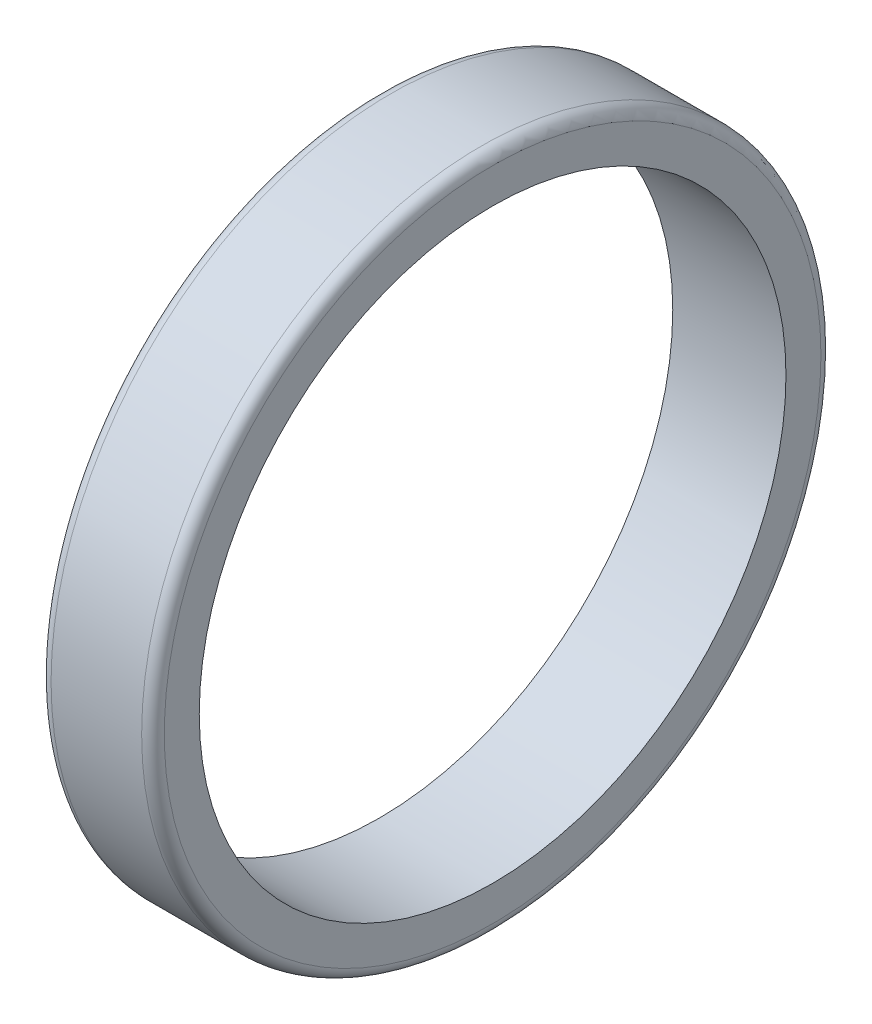
ISO-10303-21;
HEADER;
FILE_DESCRIPTION(('STEP AP214'),'2;1');
FILE_NAME('part.step','',(''),(''),'','','');
FILE_SCHEMA(('AUTOMOTIVE_DESIGN { 1 0 10303 214 1 1 1 1 }'));
ENDSEC;
DATA;
#1=APPLICATION_CONTEXT('core data for automotive mechanical design processes');
#2=APPLICATION_PROTOCOL_DEFINITION('international standard','automotive_design',2000,#1);
#3=PRODUCT_CONTEXT('',#1,'mechanical');
#4=PRODUCT('Part','Part','',(#3));
#5=PRODUCT_RELATED_PRODUCT_CATEGORY('part','',(#4));
#6=PRODUCT_DEFINITION_FORMATION('','',#4);
#7=PRODUCT_DEFINITION_CONTEXT('part definition',#1,'design');
#8=PRODUCT_DEFINITION('design','',#6,#7);
#9=PRODUCT_DEFINITION_SHAPE('','',#8);
#10=(LENGTH_UNIT() NAMED_UNIT(*) SI_UNIT(.MILLI.,.METRE.));
#11=(NAMED_UNIT(*) PLANE_ANGLE_UNIT() SI_UNIT($,.RADIAN.));
#12=(NAMED_UNIT(*) SI_UNIT($,.STERADIAN.) SOLID_ANGLE_UNIT());
#13=UNCERTAINTY_MEASURE_WITH_UNIT(LENGTH_MEASURE(1.E-05),#10,'distance_accuracy_value','');
#14=(GEOMETRIC_REPRESENTATION_CONTEXT(3) GLOBAL_UNCERTAINTY_ASSIGNED_CONTEXT((#13)) GLOBAL_UNIT_ASSIGNED_CONTEXT((#10,
#11,#12)) REPRESENTATION_CONTEXT('',''));
#15=CARTESIAN_POINT('',(0.,0.,0.));
#16=DIRECTION('',(0.,0.,1.));
#17=DIRECTION('',(1.,0.,0.));
#18=AXIS2_PLACEMENT_3D('',#15,#16,#17);
#19=CARTESIAN_POINT('',(25.4,0.,0.));
#20=DIRECTION('',(1.,0.,0.));
#21=DIRECTION('',(0.,0.,-1.));
#22=AXIS2_PLACEMENT_3D('',#19,#20,#21);
#23=PLANE('',#22);
#24=CARTESIAN_POINT('',(25.4,0.,0.));
#25=DIRECTION('',(1.,0.,0.));
#26=DIRECTION('',(0.,0.,-1.));
#27=AXIS2_PLACEMENT_3D('',#24,#25,#26);
#28=CIRCLE('',#27,73.66);
#29=CARTESIAN_POINT('',(25.4,0.,-73.66));
#30=VERTEX_POINT('',#29);
#31=EDGE_CURVE('E51',#30,#30,#28,.T.);
#32=ORIENTED_EDGE('',*,*,#31,.T.);
#33=EDGE_LOOP('',(#32));
#34=FACE_BOUND('',#33,.T.);
#35=CARTESIAN_POINT('',(25.4,0.,0.));
#36=DIRECTION('',(1.,0.,0.));
#37=DIRECTION('',(0.,0.,-1.));
#38=AXIS2_PLACEMENT_3D('',#35,#36,#37);
#39=CIRCLE('',#38,65.81775);
#40=CARTESIAN_POINT('',(25.4,0.,-65.81775));
#41=VERTEX_POINT('',#40);
#42=EDGE_CURVE('E56',#41,#41,#39,.T.);
#43=ORIENTED_EDGE('',*,*,#42,.F.);
#44=EDGE_LOOP('',(#43));
#45=FACE_BOUND('',#44,.T.);
#46=ADVANCED_FACE('F33',(#34,#45),#23,.T.);
#47=CARTESIAN_POINT('',(0.,0.,0.));
#48=DIRECTION('',(1.,0.,0.));
#49=DIRECTION('',(0.,0.,-1.));
#50=AXIS2_PLACEMENT_3D('',#47,#48,#49);
#51=PLANE('',#50);
#52=CARTESIAN_POINT('',(0.,0.,0.));
#53=DIRECTION('',(1.,0.,0.));
#54=DIRECTION('',(0.,0.,-1.));
#55=AXIS2_PLACEMENT_3D('',#52,#53,#54);
#56=CIRCLE('',#55,73.66);
#57=CARTESIAN_POINT('',(0.,0.,-73.66));
#58=VERTEX_POINT('',#57);
#59=EDGE_CURVE('E10',#58,#58,#56,.F.);
#60=ORIENTED_EDGE('',*,*,#59,.T.);
#61=EDGE_LOOP('',(#60));
#62=FACE_BOUND('',#61,.T.);
#63=CARTESIAN_POINT('',(0.,0.,0.));
#64=DIRECTION('',(1.,0.,0.));
#65=DIRECTION('',(0.,0.,-1.));
#66=AXIS2_PLACEMENT_3D('',#63,#64,#65);
#67=CIRCLE('',#66,65.81775);
#68=CARTESIAN_POINT('',(0.,0.,-65.81775));
#69=VERTEX_POINT('',#68);
#70=EDGE_CURVE('E57',#69,#69,#67,.T.);
#71=ORIENTED_EDGE('',*,*,#70,.T.);
#72=EDGE_LOOP('',(#71));
#73=FACE_BOUND('',#72,.T.);
#74=ADVANCED_FACE('F68',(#62,#73),#51,.F.);
#75=CARTESIAN_POINT('',(25.4,0.,0.));
#76=DIRECTION('',(-1.,0.,0.));
#77=DIRECTION('',(0.,0.,1.));
#78=AXIS2_PLACEMENT_3D('',#75,#76,#77);
#79=CYLINDRICAL_SURFACE('',#78,76.2);
#80=CARTESIAN_POINT('',(22.86,0.,0.));
#81=DIRECTION('',(1.,0.,0.));
#82=DIRECTION('',(0.,0.,-1.));
#83=AXIS2_PLACEMENT_3D('',#80,#81,#82);
#84=CIRCLE('',#83,76.2);
#85=CARTESIAN_POINT('',(22.86,0.,-76.2));
#86=VERTEX_POINT('',#85);
#87=EDGE_CURVE('E41',#86,#86,#84,.F.);
#88=ORIENTED_EDGE('',*,*,#87,.T.);
#89=EDGE_LOOP('',(#88));
#90=FACE_BOUND('',#89,.T.);
#91=CARTESIAN_POINT('',(2.54,0.,0.));
#92=DIRECTION('',(1.,0.,0.));
#93=DIRECTION('',(0.,0.,-1.));
#94=AXIS2_PLACEMENT_3D('',#91,#92,#93);
#95=CIRCLE('',#94,76.2);
#96=CARTESIAN_POINT('',(2.54,0.,-76.2));
#97=VERTEX_POINT('',#96);
#98=EDGE_CURVE('E47',#97,#97,#95,.T.);
#99=ORIENTED_EDGE('',*,*,#98,.T.);
#100=EDGE_LOOP('',(#99));
#101=FACE_BOUND('',#100,.T.);
#102=ADVANCED_FACE('F75',(#90,#101),#79,.T.);
#103=CARTESIAN_POINT('',(25.4,0.,0.));
#104=DIRECTION('',(-1.,0.,0.));
#105=DIRECTION('',(0.,0.,1.));
#106=AXIS2_PLACEMENT_3D('',#103,#104,#105);
#107=CYLINDRICAL_SURFACE('',#106,65.81775);
#108=ORIENTED_EDGE('',*,*,#42,.T.);
#109=EDGE_LOOP('',(#108));
#110=FACE_BOUND('',#109,.T.);
#111=ORIENTED_EDGE('',*,*,#70,.F.);
#112=EDGE_LOOP('',(#111));
#113=FACE_BOUND('',#112,.T.);
#114=ADVANCED_FACE('F64',(#110,#113),#107,.F.);
#115=CARTESIAN_POINT('',(22.86,0.,0.));
#116=DIRECTION('',(1.,0.,0.));
#117=DIRECTION('',(0.,0.,-1.));
#118=AXIS2_PLACEMENT_3D('',#115,#116,#117);
#119=TOROIDAL_SURFACE('',#118,73.66,2.54);
#120=ORIENTED_EDGE('',*,*,#87,.F.);
#121=EDGE_LOOP('',(#120));
#122=FACE_BOUND('',#121,.T.);
#123=ORIENTED_EDGE('',*,*,#31,.F.);
#124=EDGE_LOOP('',(#123));
#125=FACE_BOUND('',#124,.T.);
#126=ADVANCED_FACE('F80',(#122,#125),#119,.T.);
#127=CARTESIAN_POINT('',(2.54,0.,0.));
#128=DIRECTION('',(1.,0.,0.));
#129=DIRECTION('',(0.,0.,-1.));
#130=AXIS2_PLACEMENT_3D('',#127,#128,#129);
#131=TOROIDAL_SURFACE('',#130,73.66,2.54);
#132=ORIENTED_EDGE('',*,*,#59,.F.);
#133=EDGE_LOOP('',(#132));
#134=FACE_BOUND('',#133,.T.);
#135=ORIENTED_EDGE('',*,*,#98,.F.);
#136=EDGE_LOOP('',(#135));
#137=FACE_BOUND('',#136,.T.);
#138=ADVANCED_FACE('F35',(#134,#137),#131,.T.);
#139=CLOSED_SHELL('',(#46,#74,#102,#114,#126,#138));
#140=MANIFOLD_SOLID_BREP('B2',#139);
#141=ADVANCED_BREP_SHAPE_REPRESENTATION('',(#18,#140),#14);
#142=SHAPE_DEFINITION_REPRESENTATION(#9,#141);
ENDSEC;
END-ISO-10303-21;
